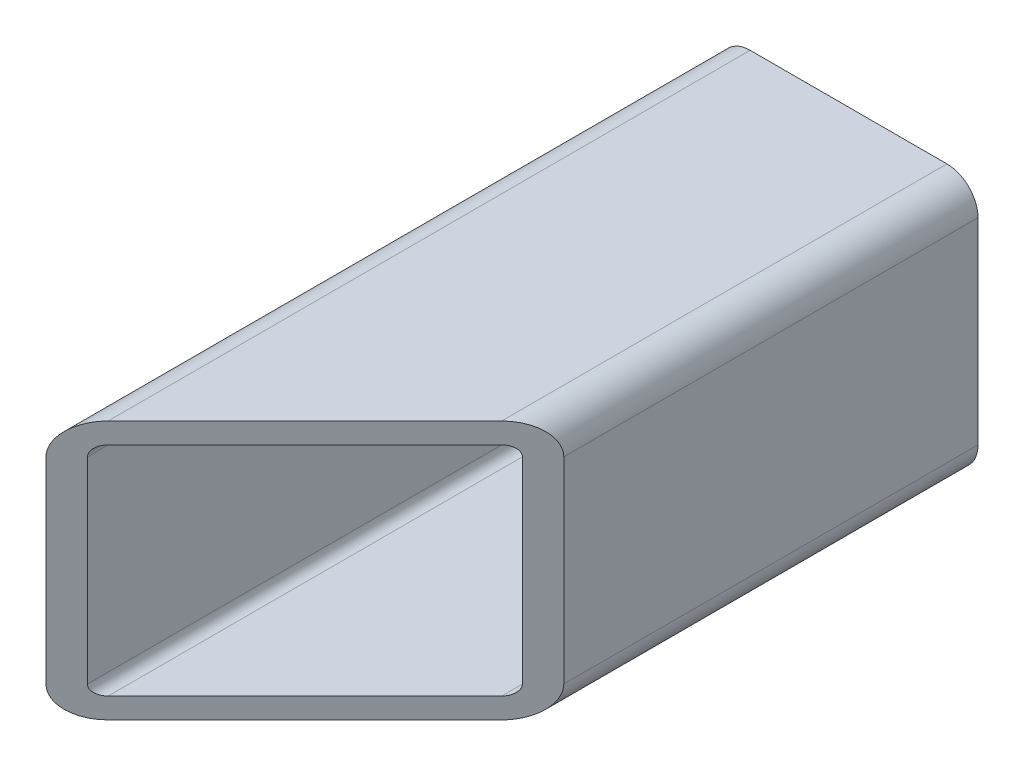
ISO-10303-21;
HEADER;
FILE_DESCRIPTION(('STEP AP214'),'2;1');
FILE_NAME('part.step','',(''),(''),'','','');
FILE_SCHEMA(('AUTOMOTIVE_DESIGN { 1 0 10303 214 1 1 1 1 }'));
ENDSEC;
DATA;
#1=APPLICATION_CONTEXT('core data for automotive mechanical design processes');
#2=APPLICATION_PROTOCOL_DEFINITION('international standard','automotive_design',2000,#1);
#3=PRODUCT_CONTEXT('',#1,'mechanical');
#4=PRODUCT('Part','Part','',(#3));
#5=PRODUCT_RELATED_PRODUCT_CATEGORY('part','',(#4));
#6=PRODUCT_DEFINITION_FORMATION('','',#4);
#7=PRODUCT_DEFINITION_CONTEXT('part definition',#1,'design');
#8=PRODUCT_DEFINITION('design','',#6,#7);
#9=PRODUCT_DEFINITION_SHAPE('','',#8);
#10=(LENGTH_UNIT() NAMED_UNIT(*) SI_UNIT(.MILLI.,.METRE.));
#11=(NAMED_UNIT(*) PLANE_ANGLE_UNIT() SI_UNIT($,.RADIAN.));
#12=(NAMED_UNIT(*) SI_UNIT($,.STERADIAN.) SOLID_ANGLE_UNIT());
#13=UNCERTAINTY_MEASURE_WITH_UNIT(LENGTH_MEASURE(1.E-05),#10,'distance_accuracy_value','');
#14=(GEOMETRIC_REPRESENTATION_CONTEXT(3) GLOBAL_UNCERTAINTY_ASSIGNED_CONTEXT((#13)) GLOBAL_UNIT_ASSIGNED_CONTEXT((#10,
#11,#12)) REPRESENTATION_CONTEXT('',''));
#15=CARTESIAN_POINT('',(0.,0.,0.));
#16=DIRECTION('',(0.,0.,1.));
#17=DIRECTION('',(1.,0.,0.));
#18=AXIS2_PLACEMENT_3D('',#15,#16,#17);
#19=CARTESIAN_POINT('',(0.,0.,0.));
#20=DIRECTION('',(0.,0.,1.));
#21=DIRECTION('',(1.,0.,0.));
#22=AXIS2_PLACEMENT_3D('',#19,#20,#21);
#23=PLANE('',#22);
#24=DIRECTION('',(0.,1.,0.));
#25=VECTOR('',#24,1.);
#26=CARTESIAN_POINT('',(-12.5,-4.75,0.));
#27=LINE('',#26,#25);
#28=CARTESIAN_POINT('',(-12.5,-9.5,0.));
#29=VERTEX_POINT('',#28);
#30=CARTESIAN_POINT('',(-12.5,9.5,0.));
#31=VERTEX_POINT('',#30);
#32=EDGE_CURVE('E11',#29,#31,#27,.T.);
#33=ORIENTED_EDGE('',*,*,#32,.T.);
#34=CARTESIAN_POINT('',(-9.5,9.5,0.));
#35=DIRECTION('',(0.,0.,-1.));
#36=DIRECTION('',(0.,-1.,0.));
#37=AXIS2_PLACEMENT_3D('',#34,#35,#36);
#38=CIRCLE('',#37,3.);
#39=CARTESIAN_POINT('',(-9.5,12.5,0.));
#40=VERTEX_POINT('',#39);
#41=EDGE_CURVE('E20',#31,#40,#38,.T.);
#42=ORIENTED_EDGE('',*,*,#41,.T.);
#43=DIRECTION('',(1.,0.,0.));
#44=VECTOR('',#43,1.);
#45=CARTESIAN_POINT('',(-4.75,12.5,0.));
#46=LINE('',#45,#44);
#47=CARTESIAN_POINT('',(9.5,12.5,0.));
#48=VERTEX_POINT('',#47);
#49=EDGE_CURVE('E221',#40,#48,#46,.T.);
#50=ORIENTED_EDGE('',*,*,#49,.T.);
#51=CARTESIAN_POINT('',(9.5,9.5,0.));
#52=DIRECTION('',(0.,0.,-1.));
#53=DIRECTION('',(-1.,0.,0.));
#54=AXIS2_PLACEMENT_3D('',#51,#52,#53);
#55=CIRCLE('',#54,3.);
#56=CARTESIAN_POINT('',(12.5,9.5,0.));
#57=VERTEX_POINT('',#56);
#58=EDGE_CURVE('E229',#48,#57,#55,.T.);
#59=ORIENTED_EDGE('',*,*,#58,.T.);
#60=DIRECTION('',(0.,-1.,0.));
#61=VECTOR('',#60,1.);
#62=CARTESIAN_POINT('',(12.5,4.75,0.));
#63=LINE('',#62,#61);
#64=CARTESIAN_POINT('',(12.5,-9.5,0.));
#65=VERTEX_POINT('',#64);
#66=EDGE_CURVE('E201',#57,#65,#63,.T.);
#67=ORIENTED_EDGE('',*,*,#66,.T.);
#68=CARTESIAN_POINT('',(9.5,-9.5,0.));
#69=DIRECTION('',(0.,0.,-1.));
#70=DIRECTION('',(0.,1.,0.));
#71=AXIS2_PLACEMENT_3D('',#68,#69,#70);
#72=CIRCLE('',#71,3.);
#73=CARTESIAN_POINT('',(9.5,-12.5,0.));
#74=VERTEX_POINT('',#73);
#75=EDGE_CURVE('E163',#65,#74,#72,.T.);
#76=ORIENTED_EDGE('',*,*,#75,.T.);
#77=DIRECTION('',(-1.,0.,0.));
#78=VECTOR('',#77,1.);
#79=CARTESIAN_POINT('',(4.75,-12.5,0.));
#80=LINE('',#79,#78);
#81=CARTESIAN_POINT('',(-9.5,-12.5,0.));
#82=VERTEX_POINT('',#81);
#83=EDGE_CURVE('E202',#74,#82,#80,.T.);
#84=ORIENTED_EDGE('',*,*,#83,.T.);
#85=CARTESIAN_POINT('',(-9.5,-9.5,0.));
#86=DIRECTION('',(0.,0.,-1.));
#87=DIRECTION('',(1.,0.,0.));
#88=AXIS2_PLACEMENT_3D('',#85,#86,#87);
#89=CIRCLE('',#88,3.);
#90=EDGE_CURVE('E27',#82,#29,#89,.T.);
#91=ORIENTED_EDGE('',*,*,#90,.T.);
#92=EDGE_LOOP('',(#33,#42,#50,#59,#67,#76,#84,#91));
#93=FACE_BOUND('',#92,.T.);
#94=DIRECTION('',(-1.,0.,0.));
#95=VECTOR('',#94,1.);
#96=CARTESIAN_POINT('',(-4.75,10.5,0.));
#97=LINE('',#96,#95);
#98=CARTESIAN_POINT('',(9.5,10.5,0.));
#99=VERTEX_POINT('',#98);
#100=CARTESIAN_POINT('',(-9.5,10.5,0.));
#101=VERTEX_POINT('',#100);
#102=EDGE_CURVE('E183',#99,#101,#97,.T.);
#103=ORIENTED_EDGE('',*,*,#102,.T.);
#104=CARTESIAN_POINT('',(-9.5,9.5,0.));
#105=DIRECTION('',(0.,0.,1.));
#106=DIRECTION('',(0.,-1.,0.));
#107=AXIS2_PLACEMENT_3D('',#104,#105,#106);
#108=CIRCLE('',#107,1.);
#109=CARTESIAN_POINT('',(-10.5,9.5,0.));
#110=VERTEX_POINT('',#109);
#111=EDGE_CURVE('E210',#101,#110,#108,.T.);
#112=ORIENTED_EDGE('',*,*,#111,.T.);
#113=DIRECTION('',(0.,-1.,0.));
#114=VECTOR('',#113,1.);
#115=CARTESIAN_POINT('',(-10.5,-4.75,0.));
#116=LINE('',#115,#114);
#117=CARTESIAN_POINT('',(-10.5,-9.5,0.));
#118=VERTEX_POINT('',#117);
#119=EDGE_CURVE('E211',#110,#118,#116,.T.);
#120=ORIENTED_EDGE('',*,*,#119,.T.);
#121=CARTESIAN_POINT('',(-9.5,-9.5,0.));
#122=DIRECTION('',(0.,0.,1.));
#123=DIRECTION('',(1.,0.,0.));
#124=AXIS2_PLACEMENT_3D('',#121,#122,#123);
#125=CIRCLE('',#124,1.);
#126=CARTESIAN_POINT('',(-9.5,-10.5,0.));
#127=VERTEX_POINT('',#126);
#128=EDGE_CURVE('E251',#118,#127,#125,.T.);
#129=ORIENTED_EDGE('',*,*,#128,.T.);
#130=DIRECTION('',(1.,0.,0.));
#131=VECTOR('',#130,1.);
#132=CARTESIAN_POINT('',(4.75,-10.5,0.));
#133=LINE('',#132,#131);
#134=CARTESIAN_POINT('',(9.5,-10.5,0.));
#135=VERTEX_POINT('',#134);
#136=EDGE_CURVE('E134',#127,#135,#133,.T.);
#137=ORIENTED_EDGE('',*,*,#136,.T.);
#138=CARTESIAN_POINT('',(9.5,-9.5,0.));
#139=DIRECTION('',(0.,0.,1.));
#140=DIRECTION('',(0.,1.,0.));
#141=AXIS2_PLACEMENT_3D('',#138,#139,#140);
#142=CIRCLE('',#141,1.);
#143=CARTESIAN_POINT('',(10.5,-9.5,0.));
#144=VERTEX_POINT('',#143);
#145=EDGE_CURVE('E133',#135,#144,#142,.T.);
#146=ORIENTED_EDGE('',*,*,#145,.T.);
#147=DIRECTION('',(0.,1.,0.));
#148=VECTOR('',#147,1.);
#149=CARTESIAN_POINT('',(10.5,4.75,0.));
#150=LINE('',#149,#148);
#151=CARTESIAN_POINT('',(10.5,9.5,0.));
#152=VERTEX_POINT('',#151);
#153=EDGE_CURVE('E129',#144,#152,#150,.T.);
#154=ORIENTED_EDGE('',*,*,#153,.T.);
#155=CARTESIAN_POINT('',(9.5,9.5,0.));
#156=DIRECTION('',(0.,0.,1.));
#157=DIRECTION('',(-1.,0.,0.));
#158=AXIS2_PLACEMENT_3D('',#155,#156,#157);
#159=CIRCLE('',#158,1.);
#160=EDGE_CURVE('E174',#152,#99,#159,.T.);
#161=ORIENTED_EDGE('',*,*,#160,.T.);
#162=EDGE_LOOP('',(#103,#112,#120,#129,#137,#146,#154,#161));
#163=FACE_BOUND('',#162,.T.);
#164=ADVANCED_FACE('F16',(#93,#163),#23,.F.);
#165=CARTESIAN_POINT('',(-12.5,-9.5,0.));
#166=DIRECTION('',(-1.,0.,0.));
#167=DIRECTION('',(0.,1.,0.));
#168=AXIS2_PLACEMENT_3D('',#165,#166,#167);
#169=PLANE('',#168);
#170=DIRECTION('',(0.,1.,0.));
#171=VECTOR('',#170,1.);
#172=CARTESIAN_POINT('',(-12.5,-4.75,65.0000001));
#173=LINE('',#172,#171);
#174=CARTESIAN_POINT('',(-12.5,-9.5,65.0000001));
#175=VERTEX_POINT('',#174);
#176=CARTESIAN_POINT('',(-12.5,9.5,65.0000001));
#177=VERTEX_POINT('',#176);
#178=EDGE_CURVE('E197',#175,#177,#173,.T.);
#179=ORIENTED_EDGE('',*,*,#178,.T.);
#180=DIRECTION('',(0.,0.,1.));
#181=VECTOR('',#180,1.);
#182=CARTESIAN_POINT('',(-12.5,9.5,0.));
#183=LINE('',#182,#181);
#184=EDGE_CURVE('E222',#31,#177,#183,.T.);
#185=ORIENTED_EDGE('',*,*,#184,.F.);
#186=ORIENTED_EDGE('',*,*,#32,.F.);
#187=DIRECTION('',(0.,0.,1.));
#188=VECTOR('',#187,1.);
#189=CARTESIAN_POINT('',(-12.5,-9.5,0.));
#190=LINE('',#189,#188);
#191=EDGE_CURVE('E206',#29,#175,#190,.T.);
#192=ORIENTED_EDGE('',*,*,#191,.T.);
#193=EDGE_LOOP('',(#179,#185,#186,#192));
#194=FACE_BOUND('',#193,.T.);
#195=ADVANCED_FACE('F562',(#194),#169,.T.);
#196=CARTESIAN_POINT('',(-9.5,-9.5,0.));
#197=DIRECTION('',(0.,0.,1.));
#198=DIRECTION('',(1.,0.,0.));
#199=AXIS2_PLACEMENT_3D('',#196,#197,#198);
#200=CYLINDRICAL_SURFACE('',#199,3.);
#201=CARTESIAN_POINT('',(-9.5,-9.5,62.));
#202=DIRECTION('',(-0.707106781186548,0.,-0.707106781186547));
#203=DIRECTION('',(0.707106781186547,0.,-0.707106781186548));
#204=AXIS2_PLACEMENT_3D('',#201,#202,#203);
#205=ELLIPSE('',#204,4.24264068711929,3.);
#206=CARTESIAN_POINT('',(-9.5,-12.5,62.));
#207=VERTEX_POINT('',#206);
#208=EDGE_CURVE('E304',#207,#175,#205,.T.);
#209=ORIENTED_EDGE('',*,*,#208,.T.);
#210=ORIENTED_EDGE('',*,*,#191,.F.);
#211=ORIENTED_EDGE('',*,*,#90,.F.);
#212=DIRECTION('',(0.,0.,1.));
#213=VECTOR('',#212,1.);
#214=CARTESIAN_POINT('',(-9.5,-12.5,0.));
#215=LINE('',#214,#213);
#216=EDGE_CURVE('E167',#82,#207,#215,.T.);
#217=ORIENTED_EDGE('',*,*,#216,.T.);
#218=EDGE_LOOP('',(#209,#210,#211,#217));
#219=FACE_BOUND('',#218,.T.);
#220=ADVANCED_FACE('F567',(#219),#200,.T.);
#221=CARTESIAN_POINT('',(9.5,-12.5,0.));
#222=DIRECTION('',(0.,-1.,0.));
#223=DIRECTION('',(0.,0.,-1.));
#224=AXIS2_PLACEMENT_3D('',#221,#222,#223);
#225=PLANE('',#224);
#226=DIRECTION('',(-0.707106781186547,0.,0.707106781186548));
#227=VECTOR('',#226,1.);
#228=CARTESIAN_POINT('',(28.625,-12.5,23.875));
#229=LINE('',#228,#227);
#230=CARTESIAN_POINT('',(9.5,-12.5,43.));
#231=VERTEX_POINT('',#230);
#232=EDGE_CURVE('E189',#231,#207,#229,.T.);
#233=ORIENTED_EDGE('',*,*,#232,.T.);
#234=ORIENTED_EDGE('',*,*,#216,.F.);
#235=ORIENTED_EDGE('',*,*,#83,.F.);
#236=DIRECTION('',(0.,0.,1.));
#237=VECTOR('',#236,1.);
#238=CARTESIAN_POINT('',(9.5,-12.5,0.));
#239=LINE('',#238,#237);
#240=EDGE_CURVE('E168',#74,#231,#239,.T.);
#241=ORIENTED_EDGE('',*,*,#240,.T.);
#242=EDGE_LOOP('',(#233,#234,#235,#241));
#243=FACE_BOUND('',#242,.T.);
#244=ADVANCED_FACE('F597',(#243),#225,.T.);
#245=CARTESIAN_POINT('',(9.5,-9.5,0.));
#246=DIRECTION('',(0.,0.,1.));
#247=DIRECTION('',(0.,1.,0.));
#248=AXIS2_PLACEMENT_3D('',#245,#246,#247);
#249=CYLINDRICAL_SURFACE('',#248,3.);
#250=CARTESIAN_POINT('',(9.5,-9.5,43.));
#251=DIRECTION('',(-0.707106781186548,0.,-0.707106781186547));
#252=DIRECTION('',(-0.707106781186547,0.,0.707106781186548));
#253=AXIS2_PLACEMENT_3D('',#250,#251,#252);
#254=ELLIPSE('',#253,4.24264068711929,3.);
#255=CARTESIAN_POINT('',(12.5,-9.5,40.));
#256=VERTEX_POINT('',#255);
#257=EDGE_CURVE('E184',#256,#231,#254,.T.);
#258=ORIENTED_EDGE('',*,*,#257,.T.);
#259=ORIENTED_EDGE('',*,*,#240,.F.);
#260=ORIENTED_EDGE('',*,*,#75,.F.);
#261=DIRECTION('',(0.,0.,1.));
#262=VECTOR('',#261,1.);
#263=CARTESIAN_POINT('',(12.5,-9.5,0.));
#264=LINE('',#263,#262);
#265=EDGE_CURVE('E178',#65,#256,#264,.T.);
#266=ORIENTED_EDGE('',*,*,#265,.T.);
#267=EDGE_LOOP('',(#258,#259,#260,#266));
#268=FACE_BOUND('',#267,.T.);
#269=ADVANCED_FACE('F353',(#268),#249,.T.);
#270=CARTESIAN_POINT('',(12.5,9.5,0.));
#271=DIRECTION('',(1.,0.,0.));
#272=DIRECTION('',(0.,1.,0.));
#273=AXIS2_PLACEMENT_3D('',#270,#271,#272);
#274=PLANE('',#273);
#275=DIRECTION('',(0.,-1.,0.));
#276=VECTOR('',#275,1.);
#277=CARTESIAN_POINT('',(12.5,4.75,40.));
#278=LINE('',#277,#276);
#279=CARTESIAN_POINT('',(12.5,9.5,40.));
#280=VERTEX_POINT('',#279);
#281=EDGE_CURVE('E145',#280,#256,#278,.T.);
#282=ORIENTED_EDGE('',*,*,#281,.T.);
#283=ORIENTED_EDGE('',*,*,#265,.F.);
#284=ORIENTED_EDGE('',*,*,#66,.F.);
#285=DIRECTION('',(0.,0.,1.));
#286=VECTOR('',#285,1.);
#287=CARTESIAN_POINT('',(12.5,9.5,0.));
#288=LINE('',#287,#286);
#289=EDGE_CURVE('E161',#57,#280,#288,.T.);
#290=ORIENTED_EDGE('',*,*,#289,.T.);
#291=EDGE_LOOP('',(#282,#283,#284,#290));
#292=FACE_BOUND('',#291,.T.);
#293=ADVANCED_FACE('F358',(#292),#274,.T.);
#294=CARTESIAN_POINT('',(9.5,9.5,0.));
#295=DIRECTION('',(0.,0.,1.));
#296=DIRECTION('',(-1.,0.,0.));
#297=AXIS2_PLACEMENT_3D('',#294,#295,#296);
#298=CYLINDRICAL_SURFACE('',#297,1.);
#299=CARTESIAN_POINT('',(9.5,9.5,43.));
#300=DIRECTION('',(0.707106781186548,0.,0.707106781186547));
#301=DIRECTION('',(-0.707106781186547,0.,0.707106781186548));
#302=AXIS2_PLACEMENT_3D('',#299,#300,#301);
#303=ELLIPSE('',#302,1.4142135623731,1.);
#304=CARTESIAN_POINT('',(10.5,9.5,42.));
#305=VERTEX_POINT('',#304);
#306=CARTESIAN_POINT('',(9.5,10.5,43.));
#307=VERTEX_POINT('',#306);
#308=EDGE_CURVE('E150',#305,#307,#303,.T.);
#309=ORIENTED_EDGE('',*,*,#308,.T.);
#310=DIRECTION('',(0.,0.,1.));
#311=VECTOR('',#310,1.);
#312=CARTESIAN_POINT('',(9.5,10.5,0.));
#313=LINE('',#312,#311);
#314=EDGE_CURVE('E179',#99,#307,#313,.T.);
#315=ORIENTED_EDGE('',*,*,#314,.F.);
#316=ORIENTED_EDGE('',*,*,#160,.F.);
#317=DIRECTION('',(0.,0.,1.));
#318=VECTOR('',#317,1.);
#319=CARTESIAN_POINT('',(10.5,9.5,0.));
#320=LINE('',#319,#318);
#321=EDGE_CURVE('E235',#152,#305,#320,.T.);
#322=ORIENTED_EDGE('',*,*,#321,.T.);
#323=EDGE_LOOP('',(#309,#315,#316,#322));
#324=FACE_BOUND('',#323,.T.);
#325=ADVANCED_FACE('F583',(#324),#298,.F.);
#326=CARTESIAN_POINT('',(10.5,9.5,0.));
#327=DIRECTION('',(1.,0.,0.));
#328=DIRECTION('',(0.,-1.,0.));
#329=AXIS2_PLACEMENT_3D('',#326,#327,#328);
#330=PLANE('',#329);
#331=DIRECTION('',(0.,1.,0.));
#332=VECTOR('',#331,1.);
#333=CARTESIAN_POINT('',(10.5,4.75,42.));
#334=LINE('',#333,#332);
#335=CARTESIAN_POINT('',(10.5,-9.5,42.));
#336=VERTEX_POINT('',#335);
#337=EDGE_CURVE('E126',#336,#305,#334,.T.);
#338=ORIENTED_EDGE('',*,*,#337,.T.);
#339=ORIENTED_EDGE('',*,*,#321,.F.);
#340=ORIENTED_EDGE('',*,*,#153,.F.);
#341=DIRECTION('',(0.,0.,1.));
#342=VECTOR('',#341,1.);
#343=CARTESIAN_POINT('',(10.5,-9.5,0.));
#344=LINE('',#343,#342);
#345=EDGE_CURVE('E121',#144,#336,#344,.T.);
#346=ORIENTED_EDGE('',*,*,#345,.T.);
#347=EDGE_LOOP('',(#338,#339,#340,#346));
#348=FACE_BOUND('',#347,.T.);
#349=ADVANCED_FACE('F123',(#348),#330,.F.);
#350=CARTESIAN_POINT('',(9.5,-9.5,0.));
#351=DIRECTION('',(0.,0.,1.));
#352=DIRECTION('',(0.,1.,0.));
#353=AXIS2_PLACEMENT_3D('',#350,#351,#352);
#354=CYLINDRICAL_SURFACE('',#353,1.);
#355=CARTESIAN_POINT('',(9.5,-9.5,43.));
#356=DIRECTION('',(0.707106781186548,0.,0.707106781186547));
#357=DIRECTION('',(-0.707106781186547,0.,0.707106781186548));
#358=AXIS2_PLACEMENT_3D('',#355,#356,#357);
#359=ELLIPSE('',#358,1.4142135623731,1.);
#360=CARTESIAN_POINT('',(9.5,-10.5,43.));
#361=VERTEX_POINT('',#360);
#362=EDGE_CURVE('E137',#361,#336,#359,.T.);
#363=ORIENTED_EDGE('',*,*,#362,.T.);
#364=ORIENTED_EDGE('',*,*,#345,.F.);
#365=ORIENTED_EDGE('',*,*,#145,.F.);
#366=DIRECTION('',(0.,0.,1.));
#367=VECTOR('',#366,1.);
#368=CARTESIAN_POINT('',(9.5,-10.5,0.));
#369=LINE('',#368,#367);
#370=EDGE_CURVE('E140',#135,#361,#369,.T.);
#371=ORIENTED_EDGE('',*,*,#370,.T.);
#372=EDGE_LOOP('',(#363,#364,#365,#371));
#373=FACE_BOUND('',#372,.T.);
#374=ADVANCED_FACE('F138',(#373),#354,.F.);
#375=CARTESIAN_POINT('',(9.5,-10.5,0.));
#376=DIRECTION('',(0.,-1.,0.));
#377=DIRECTION('',(0.,0.,-1.));
#378=AXIS2_PLACEMENT_3D('',#375,#376,#377);
#379=PLANE('',#378);
#380=DIRECTION('',(0.707106781186547,0.,-0.707106781186548));
#381=VECTOR('',#380,1.);
#382=CARTESIAN_POINT('',(28.625,-10.5,23.875));
#383=LINE('',#382,#381);
#384=CARTESIAN_POINT('',(-9.5,-10.5,62.));
#385=VERTEX_POINT('',#384);
#386=EDGE_CURVE('E247',#385,#361,#383,.T.);
#387=ORIENTED_EDGE('',*,*,#386,.T.);
#388=ORIENTED_EDGE('',*,*,#370,.F.);
#389=ORIENTED_EDGE('',*,*,#136,.F.);
#390=DIRECTION('',(0.,0.,1.));
#391=VECTOR('',#390,1.);
#392=CARTESIAN_POINT('',(-9.5,-10.5,0.));
#393=LINE('',#392,#391);
#394=EDGE_CURVE('E215',#127,#385,#393,.T.);
#395=ORIENTED_EDGE('',*,*,#394,.T.);
#396=EDGE_LOOP('',(#387,#388,#389,#395));
#397=FACE_BOUND('',#396,.T.);
#398=ADVANCED_FACE('F492',(#397),#379,.F.);
#399=CARTESIAN_POINT('',(9.5,9.5,0.));
#400=DIRECTION('',(0.,0.,1.));
#401=DIRECTION('',(-1.,0.,0.));
#402=AXIS2_PLACEMENT_3D('',#399,#400,#401);
#403=CYLINDRICAL_SURFACE('',#402,3.);
#404=CARTESIAN_POINT('',(9.5,9.5,43.));
#405=DIRECTION('',(-0.707106781186548,0.,-0.707106781186547));
#406=DIRECTION('',(-0.707106781186547,0.,0.707106781186548));
#407=AXIS2_PLACEMENT_3D('',#404,#405,#406);
#408=ELLIPSE('',#407,4.24264068711929,3.);
#409=CARTESIAN_POINT('',(9.5,12.5,43.));
#410=VERTEX_POINT('',#409);
#411=EDGE_CURVE('E169',#410,#280,#408,.T.);
#412=ORIENTED_EDGE('',*,*,#411,.T.);
#413=ORIENTED_EDGE('',*,*,#289,.F.);
#414=ORIENTED_EDGE('',*,*,#58,.F.);
#415=DIRECTION('',(0.,0.,1.));
#416=VECTOR('',#415,1.);
#417=CARTESIAN_POINT('',(9.5,12.5,0.));
#418=LINE('',#417,#416);
#419=EDGE_CURVE('E217',#48,#410,#418,.T.);
#420=ORIENTED_EDGE('',*,*,#419,.T.);
#421=EDGE_LOOP('',(#412,#413,#414,#420));
#422=FACE_BOUND('',#421,.T.);
#423=ADVANCED_FACE('F344',(#422),#403,.T.);
#424=CARTESIAN_POINT('',(-9.5,12.5,0.));
#425=DIRECTION('',(0.,1.,0.));
#426=DIRECTION('',(1.,0.,0.));
#427=AXIS2_PLACEMENT_3D('',#424,#425,#426);
#428=PLANE('',#427);
#429=DIRECTION('',(0.707106781186547,0.,-0.707106781186548));
#430=VECTOR('',#429,1.);
#431=CARTESIAN_POINT('',(23.875,12.5,28.625));
#432=LINE('',#431,#430);
#433=CARTESIAN_POINT('',(-9.5,12.5,62.));
#434=VERTEX_POINT('',#433);
#435=EDGE_CURVE('E173',#434,#410,#432,.T.);
#436=ORIENTED_EDGE('',*,*,#435,.T.);
#437=ORIENTED_EDGE('',*,*,#419,.F.);
#438=ORIENTED_EDGE('',*,*,#49,.F.);
#439=DIRECTION('',(0.,0.,1.));
#440=VECTOR('',#439,1.);
#441=CARTESIAN_POINT('',(-9.5,12.5,0.));
#442=LINE('',#441,#440);
#443=EDGE_CURVE('E255',#40,#434,#442,.T.);
#444=ORIENTED_EDGE('',*,*,#443,.T.);
#445=EDGE_LOOP('',(#436,#437,#438,#444));
#446=FACE_BOUND('',#445,.T.);
#447=ADVANCED_FACE('F341',(#446),#428,.T.);
#448=CARTESIAN_POINT('',(-9.5,9.5,0.));
#449=DIRECTION('',(0.,0.,1.));
#450=DIRECTION('',(0.,-1.,0.));
#451=AXIS2_PLACEMENT_3D('',#448,#449,#450);
#452=CYLINDRICAL_SURFACE('',#451,3.);
#453=CARTESIAN_POINT('',(-9.5,9.5,62.));
#454=DIRECTION('',(-0.707106781186548,0.,-0.707106781186547));
#455=DIRECTION('',(0.707106781186547,0.,-0.707106781186548));
#456=AXIS2_PLACEMENT_3D('',#453,#454,#455);
#457=ELLIPSE('',#456,4.24264068711929,3.);
#458=EDGE_CURVE('E193',#177,#434,#457,.T.);
#459=ORIENTED_EDGE('',*,*,#458,.T.);
#460=ORIENTED_EDGE('',*,*,#443,.F.);
#461=ORIENTED_EDGE('',*,*,#41,.F.);
#462=ORIENTED_EDGE('',*,*,#184,.T.);
#463=EDGE_LOOP('',(#459,#460,#461,#462));
#464=FACE_BOUND('',#463,.T.);
#465=ADVANCED_FACE('F336',(#464),#452,.T.);
#466=CARTESIAN_POINT('',(-9.5,-9.5,0.));
#467=DIRECTION('',(0.,0.,1.));
#468=DIRECTION('',(1.,0.,0.));
#469=AXIS2_PLACEMENT_3D('',#466,#467,#468);
#470=CYLINDRICAL_SURFACE('',#469,1.);
#471=CARTESIAN_POINT('',(-9.5,-9.5,62.));
#472=DIRECTION('',(0.707106781186548,0.,0.707106781186547));
#473=DIRECTION('',(0.707106781186547,0.,-0.707106781186548));
#474=AXIS2_PLACEMENT_3D('',#471,#472,#473);
#475=ELLIPSE('',#474,1.4142135623731,1.);
#476=CARTESIAN_POINT('',(-10.5,-9.5,63.));
#477=VERTEX_POINT('',#476);
#478=EDGE_CURVE('E228',#477,#385,#475,.T.);
#479=ORIENTED_EDGE('',*,*,#478,.T.);
#480=ORIENTED_EDGE('',*,*,#394,.F.);
#481=ORIENTED_EDGE('',*,*,#128,.F.);
#482=DIRECTION('',(0.,0.,1.));
#483=VECTOR('',#482,1.);
#484=CARTESIAN_POINT('',(-10.5,-9.5,0.));
#485=LINE('',#484,#483);
#486=EDGE_CURVE('E216',#118,#477,#485,.T.);
#487=ORIENTED_EDGE('',*,*,#486,.T.);
#488=EDGE_LOOP('',(#479,#480,#481,#487));
#489=FACE_BOUND('',#488,.T.);
#490=ADVANCED_FACE('F497',(#489),#470,.F.);
#491=CARTESIAN_POINT('',(-10.5,-9.5,0.));
#492=DIRECTION('',(-1.,0.,0.));
#493=DIRECTION('',(0.,0.,1.));
#494=AXIS2_PLACEMENT_3D('',#491,#492,#493);
#495=PLANE('',#494);
#496=DIRECTION('',(0.,-1.,0.));
#497=VECTOR('',#496,1.);
#498=CARTESIAN_POINT('',(-10.5,-4.75,63.));
#499=LINE('',#498,#497);
#500=CARTESIAN_POINT('',(-10.5,9.5,63.));
#501=VERTEX_POINT('',#500);
#502=EDGE_CURVE('E223',#501,#477,#499,.T.);
#503=ORIENTED_EDGE('',*,*,#502,.T.);
#504=ORIENTED_EDGE('',*,*,#486,.F.);
#505=ORIENTED_EDGE('',*,*,#119,.F.);
#506=DIRECTION('',(0.,0.,1.));
#507=VECTOR('',#506,1.);
#508=CARTESIAN_POINT('',(-10.5,9.5,0.));
#509=LINE('',#508,#507);
#510=EDGE_CURVE('E182',#110,#501,#509,.T.);
#511=ORIENTED_EDGE('',*,*,#510,.T.);
#512=EDGE_LOOP('',(#503,#504,#505,#511));
#513=FACE_BOUND('',#512,.T.);
#514=ADVANCED_FACE('F501',(#513),#495,.F.);
#515=CARTESIAN_POINT('',(-9.5,9.5,0.));
#516=DIRECTION('',(0.,0.,1.));
#517=DIRECTION('',(0.,-1.,0.));
#518=AXIS2_PLACEMENT_3D('',#515,#516,#517);
#519=CYLINDRICAL_SURFACE('',#518,1.);
#520=CARTESIAN_POINT('',(-9.5,9.5,62.));
#521=DIRECTION('',(0.707106781186548,0.,0.707106781186547));
#522=DIRECTION('',(0.707106781186547,0.,-0.707106781186548));
#523=AXIS2_PLACEMENT_3D('',#520,#521,#522);
#524=ELLIPSE('',#523,1.4142135623731,1.);
#525=CARTESIAN_POINT('',(-9.5,10.5,62.));
#526=VERTEX_POINT('',#525);
#527=EDGE_CURVE('E227',#526,#501,#524,.T.);
#528=ORIENTED_EDGE('',*,*,#527,.T.);
#529=ORIENTED_EDGE('',*,*,#510,.F.);
#530=ORIENTED_EDGE('',*,*,#111,.F.);
#531=DIRECTION('',(0.,0.,1.));
#532=VECTOR('',#531,1.);
#533=CARTESIAN_POINT('',(-9.5,10.5,0.));
#534=LINE('',#533,#532);
#535=EDGE_CURVE('E188',#101,#526,#534,.T.);
#536=ORIENTED_EDGE('',*,*,#535,.T.);
#537=EDGE_LOOP('',(#528,#529,#530,#536));
#538=FACE_BOUND('',#537,.T.);
#539=ADVANCED_FACE('F18',(#538),#519,.F.);
#540=CARTESIAN_POINT('',(-9.5,10.5,0.));
#541=DIRECTION('',(0.,1.,0.));
#542=DIRECTION('',(1.,0.,0.));
#543=AXIS2_PLACEMENT_3D('',#540,#541,#542);
#544=PLANE('',#543);
#545=DIRECTION('',(-0.707106781186547,0.,0.707106781186548));
#546=VECTOR('',#545,1.);
#547=CARTESIAN_POINT('',(23.875,10.5,28.625));
#548=LINE('',#547,#546);
#549=EDGE_CURVE('E157',#307,#526,#548,.T.);
#550=ORIENTED_EDGE('',*,*,#549,.T.);
#551=ORIENTED_EDGE('',*,*,#535,.F.);
#552=ORIENTED_EDGE('',*,*,#102,.F.);
#553=ORIENTED_EDGE('',*,*,#314,.T.);
#554=EDGE_LOOP('',(#550,#551,#552,#553));
#555=FACE_BOUND('',#554,.T.);
#556=ADVANCED_FACE('F549',(#555),#544,.F.);
#557=CARTESIAN_POINT('',(26.25,0.,26.25));
#558=DIRECTION('',(-0.707106781186548,0.,-0.707106781186547));
#559=DIRECTION('',(-0.707106781186547,0.,0.707106781186548));
#560=AXIS2_PLACEMENT_3D('',#557,#558,#559);
#561=PLANE('',#560);
#562=ORIENTED_EDGE('',*,*,#281,.F.);
#563=ORIENTED_EDGE('',*,*,#411,.F.);
#564=ORIENTED_EDGE('',*,*,#435,.F.);
#565=ORIENTED_EDGE('',*,*,#458,.F.);
#566=ORIENTED_EDGE('',*,*,#178,.F.);
#567=ORIENTED_EDGE('',*,*,#208,.F.);
#568=ORIENTED_EDGE('',*,*,#232,.F.);
#569=ORIENTED_EDGE('',*,*,#257,.F.);
#570=EDGE_LOOP('',(#562,#563,#564,#565,#566,#567,#568,#569));
#571=FACE_BOUND('',#570,.T.);
#572=ORIENTED_EDGE('',*,*,#386,.F.);
#573=ORIENTED_EDGE('',*,*,#478,.F.);
#574=ORIENTED_EDGE('',*,*,#502,.F.);
#575=ORIENTED_EDGE('',*,*,#527,.F.);
#576=ORIENTED_EDGE('',*,*,#549,.F.);
#577=ORIENTED_EDGE('',*,*,#308,.F.);
#578=ORIENTED_EDGE('',*,*,#337,.F.);
#579=ORIENTED_EDGE('',*,*,#362,.F.);
#580=EDGE_LOOP('',(#572,#573,#574,#575,#576,#577,#578,#579));
#581=FACE_BOUND('',#580,.T.);
#582=ADVANCED_FACE('F147',(#571,#581),#561,.F.);
#583=CLOSED_SHELL('',(#164,#195,#220,#244,#269,#293,#325,#349,#374,#398,#423,#447,#465,#490,
#514,#539,#556,#582));
#584=MANIFOLD_SOLID_BREP('B1',#583);
#585=ADVANCED_BREP_SHAPE_REPRESENTATION('',(#18,#584),#14);
#586=SHAPE_DEFINITION_REPRESENTATION(#9,#585);
ENDSEC;
END-ISO-10303-21;
